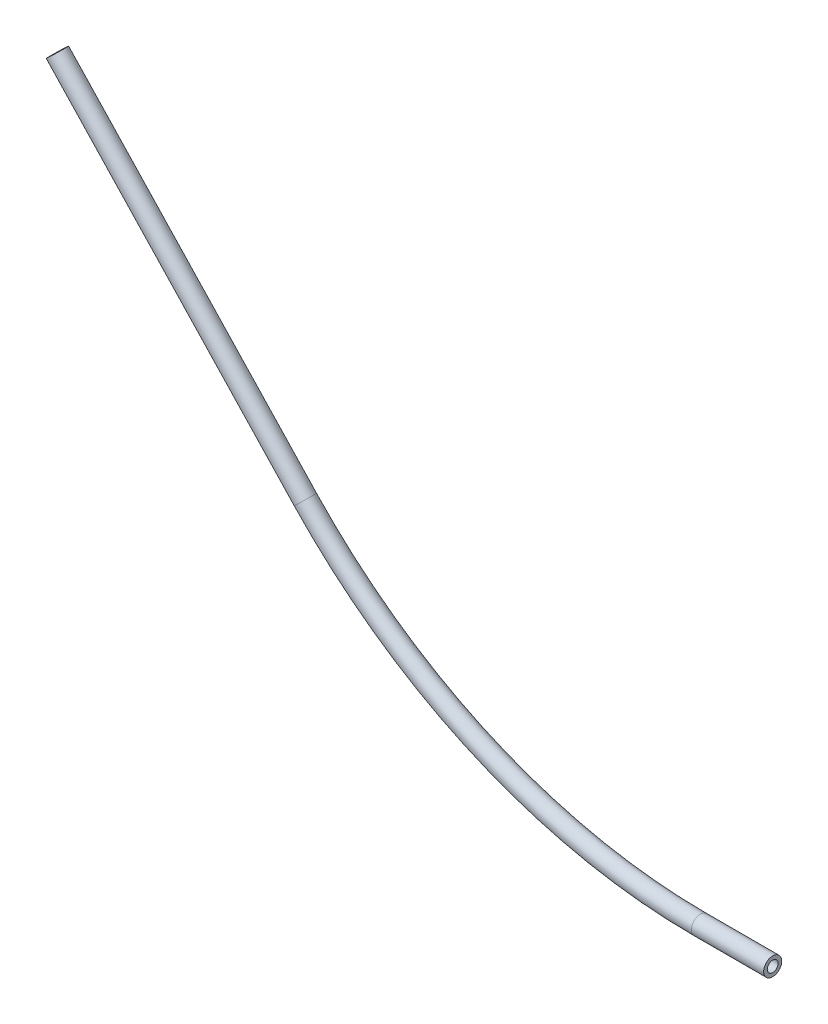
ISO-10303-21;
HEADER;
FILE_DESCRIPTION(('STEP AP214'),'2;1');
FILE_NAME('part.step','',(''),(''),'','','');
FILE_SCHEMA(('AUTOMOTIVE_DESIGN { 1 0 10303 214 1 1 1 1 }'));
ENDSEC;
DATA;
#1=APPLICATION_CONTEXT('core data for automotive mechanical design processes');
#2=APPLICATION_PROTOCOL_DEFINITION('international standard','automotive_design',2000,#1);
#3=PRODUCT_CONTEXT('',#1,'mechanical');
#4=PRODUCT('Part','Part','',(#3));
#5=PRODUCT_RELATED_PRODUCT_CATEGORY('part','',(#4));
#6=PRODUCT_DEFINITION_FORMATION('','',#4);
#7=PRODUCT_DEFINITION_CONTEXT('part definition',#1,'design');
#8=PRODUCT_DEFINITION('design','',#6,#7);
#9=PRODUCT_DEFINITION_SHAPE('','',#8);
#10=(LENGTH_UNIT() NAMED_UNIT(*) SI_UNIT(.MILLI.,.METRE.));
#11=(NAMED_UNIT(*) PLANE_ANGLE_UNIT() SI_UNIT($,.RADIAN.));
#12=(NAMED_UNIT(*) SI_UNIT($,.STERADIAN.) SOLID_ANGLE_UNIT());
#13=UNCERTAINTY_MEASURE_WITH_UNIT(LENGTH_MEASURE(1.E-05),#10,'distance_accuracy_value','');
#14=(GEOMETRIC_REPRESENTATION_CONTEXT(3) GLOBAL_UNCERTAINTY_ASSIGNED_CONTEXT((#13)) GLOBAL_UNIT_ASSIGNED_CONTEXT((#10,
#11,#12)) REPRESENTATION_CONTEXT('',''));
#15=CARTESIAN_POINT('',(0.,0.,0.));
#16=DIRECTION('',(0.,0.,1.));
#17=DIRECTION('',(1.,0.,0.));
#18=AXIS2_PLACEMENT_3D('',#15,#16,#17);
#19=CARTESIAN_POINT('',(0.,0.,0.));
#20=DIRECTION('',(-1.,0.,0.));
#21=DIRECTION('',(0.,-1.,0.));
#22=AXIS2_PLACEMENT_3D('',#19,#20,#21);
#23=CYLINDRICAL_SURFACE('',#22,3.175);
#24=CARTESIAN_POINT('',(-25.4,0.,0.));
#25=DIRECTION('',(1.,0.,0.));
#26=DIRECTION('',(0.,0.,-1.));
#27=AXIS2_PLACEMENT_3D('',#24,#25,#26);
#28=CIRCLE('',#27,3.175);
#29=CARTESIAN_POINT('',(-25.4,-3.17500000000001,0.));
#30=VERTEX_POINT('',#29);
#31=EDGE_CURVE('E96',#30,#30,#28,.T.);
#32=ORIENTED_EDGE('',*,*,#31,.T.);
#33=EDGE_LOOP('',(#32));
#34=FACE_BOUND('',#33,.T.);
#35=CARTESIAN_POINT('',(0.,0.,0.));
#36=DIRECTION('',(1.,0.,0.));
#37=DIRECTION('',(0.,0.,-1.));
#38=AXIS2_PLACEMENT_3D('',#35,#36,#37);
#39=CIRCLE('',#38,3.175);
#40=CARTESIAN_POINT('',(0.,0.,-3.175));
#41=VERTEX_POINT('',#40);
#42=EDGE_CURVE('E45',#41,#41,#39,.T.);
#43=ORIENTED_EDGE('',*,*,#42,.F.);
#44=EDGE_LOOP('',(#43));
#45=FACE_BOUND('',#44,.T.);
#46=ADVANCED_FACE('F30',(#34,#45),#23,.T.);
#47=CARTESIAN_POINT('',(-25.4,190.5,0.));
#48=DIRECTION('',(0.,0.,-1.));
#49=DIRECTION('',(-1.,0.,0.));
#50=AXIS2_PLACEMENT_3D('',#47,#48,#49);
#51=TOROIDAL_SURFACE('',#50,190.5,3.175);
#52=CARTESIAN_POINT('',(-164.110864907565,59.9260900616234,0.));
#53=DIRECTION('',(0.685427348757882,-0.728141023136824,0.));
#54=DIRECTION('',(0.,0.,-1.));
#55=AXIS2_PLACEMENT_3D('',#52,#53,#54);
#56=CIRCLE('',#55,3.175);
#57=CARTESIAN_POINT('',(-166.422712656024,57.7498582293171,0.));
#58=VERTEX_POINT('',#57);
#59=EDGE_CURVE('E34',#58,#58,#56,.T.);
#60=CARTESIAN_POINT('',(-25.4,190.5,0.));
#61=DIRECTION('',(0.,0.,-1.));
#62=DIRECTION('',(-1.,0.,0.));
#63=AXIS2_PLACEMENT_3D('',#60,#61,#62);
#64=CIRCLE('',#63,193.675);
#65=EDGE_CURVE('',#30,#58,#64,.T.);
#66=ORIENTED_EDGE('',*,*,#31,.F.);
#67=ORIENTED_EDGE('',*,*,#59,.T.);
#68=ORIENTED_EDGE('',*,*,#65,.T.);
#69=ORIENTED_EDGE('',*,*,#65,.F.);
#70=EDGE_LOOP('',(#66,#68,#67,#69));
#71=FACE_BOUND('',#70,.T.);
#72=ADVANCED_FACE('F103',(#71),#51,.T.);
#73=CARTESIAN_POINT('',(-164.110864907565,59.9260900616234,0.));
#74=DIRECTION('',(-0.685427348757882,0.728141023136823,0.));
#75=DIRECTION('',(-0.728141023136823,-0.685427348757883,0.));
#76=AXIS2_PLACEMENT_3D('',#73,#74,#75);
#77=CYLINDRICAL_SURFACE('',#76,3.175);
#78=CARTESIAN_POINT('',(-251.160138199816,152.4,0.));
#79=DIRECTION('',(0.685427348757882,-0.728141023136824,0.));
#80=DIRECTION('',(0.,0.,-1.));
#81=AXIS2_PLACEMENT_3D('',#78,#79,#80);
#82=CIRCLE('',#81,3.175);
#83=CARTESIAN_POINT('',(-251.160138199816,152.4,-3.175));
#84=VERTEX_POINT('',#83);
#85=EDGE_CURVE('E50',#84,#84,#82,.T.);
#86=ORIENTED_EDGE('',*,*,#85,.T.);
#87=EDGE_LOOP('',(#86));
#88=FACE_BOUND('',#87,.T.);
#89=ORIENTED_EDGE('',*,*,#59,.F.);
#90=EDGE_LOOP('',(#89));
#91=FACE_BOUND('',#90,.T.);
#92=ADVANCED_FACE('F32',(#88,#91),#77,.T.);
#93=CARTESIAN_POINT('',(0.,0.,0.));
#94=DIRECTION('',(1.,0.,0.));
#95=DIRECTION('',(0.,0.,-1.));
#96=AXIS2_PLACEMENT_3D('',#93,#94,#95);
#97=PLANE('',#96);
#98=CARTESIAN_POINT('',(0.,0.,0.));
#99=DIRECTION('',(1.,0.,0.));
#100=DIRECTION('',(0.,0.,-1.));
#101=AXIS2_PLACEMENT_3D('',#98,#99,#100);
#102=CIRCLE('',#101,1.905);
#103=CARTESIAN_POINT('',(0.,0.,-1.905));
#104=VERTEX_POINT('',#103);
#105=EDGE_CURVE('E89',#104,#104,#102,.F.);
#106=ORIENTED_EDGE('',*,*,#105,.T.);
#107=EDGE_LOOP('',(#106));
#108=FACE_BOUND('',#107,.T.);
#109=ORIENTED_EDGE('',*,*,#42,.T.);
#110=EDGE_LOOP('',(#109));
#111=FACE_BOUND('',#110,.T.);
#112=ADVANCED_FACE('F63',(#108,#111),#97,.T.);
#113=CARTESIAN_POINT('',(-251.160138199816,152.4,0.));
#114=DIRECTION('',(0.685427348757882,-0.728141023136824,0.));
#115=DIRECTION('',(0.,0.,-1.));
#116=AXIS2_PLACEMENT_3D('',#113,#114,#115);
#117=PLANE('',#116);
#118=CARTESIAN_POINT('',(-251.160138199816,152.4,0.));
#119=DIRECTION('',(0.685427348757882,-0.728141023136824,0.));
#120=DIRECTION('',(0.,0.,-1.));
#121=AXIS2_PLACEMENT_3D('',#118,#119,#120);
#122=CIRCLE('',#121,1.905);
#123=CARTESIAN_POINT('',(-251.160138199816,152.4,-1.905));
#124=VERTEX_POINT('',#123);
#125=EDGE_CURVE('E11',#124,#124,#122,.F.);
#126=ORIENTED_EDGE('',*,*,#125,.F.);
#127=EDGE_LOOP('',(#126));
#128=FACE_BOUND('',#127,.T.);
#129=ORIENTED_EDGE('',*,*,#85,.F.);
#130=EDGE_LOOP('',(#129));
#131=FACE_BOUND('',#130,.T.);
#132=ADVANCED_FACE('F60',(#128,#131),#117,.F.);
#133=CARTESIAN_POINT('',(0.,0.,0.));
#134=DIRECTION('',(-1.,0.,0.));
#135=DIRECTION('',(0.,-1.,0.));
#136=AXIS2_PLACEMENT_3D('',#133,#134,#135);
#137=CYLINDRICAL_SURFACE('',#136,1.905);
#138=CARTESIAN_POINT('',(-25.4,0.,0.));
#139=DIRECTION('',(1.,0.,0.));
#140=DIRECTION('',(0.,0.,-1.));
#141=AXIS2_PLACEMENT_3D('',#138,#139,#140);
#142=CIRCLE('',#141,1.905);
#143=CARTESIAN_POINT('',(-25.4,-1.90499999999999,0.));
#144=VERTEX_POINT('',#143);
#145=EDGE_CURVE('E88',#144,#144,#142,.F.);
#146=ORIENTED_EDGE('',*,*,#145,.T.);
#147=EDGE_LOOP('',(#146));
#148=FACE_BOUND('',#147,.T.);
#149=ORIENTED_EDGE('',*,*,#105,.F.);
#150=EDGE_LOOP('',(#149));
#151=FACE_BOUND('',#150,.T.);
#152=ADVANCED_FACE('F62',(#148,#151),#137,.F.);
#153=CARTESIAN_POINT('',(-25.4,190.5,0.));
#154=DIRECTION('',(0.,0.,-1.));
#155=DIRECTION('',(-1.,0.,0.));
#156=AXIS2_PLACEMENT_3D('',#153,#154,#155);
#157=TOROIDAL_SURFACE('',#156,190.5,1.905);
#158=CARTESIAN_POINT('',(-164.110864907565,59.9260900616234,0.));
#159=DIRECTION('',(0.685427348757882,-0.728141023136824,0.));
#160=DIRECTION('',(0.,0.,-1.));
#161=AXIS2_PLACEMENT_3D('',#158,#159,#160);
#162=CIRCLE('',#161,1.905);
#163=CARTESIAN_POINT('',(-165.497973556641,58.6203509622397,0.));
#164=VERTEX_POINT('',#163);
#165=EDGE_CURVE('E39',#164,#164,#162,.F.);
#166=CARTESIAN_POINT('',(-25.4,190.5,0.));
#167=DIRECTION('',(0.,0.,-1.));
#168=DIRECTION('',(-1.,0.,0.));
#169=AXIS2_PLACEMENT_3D('',#166,#167,#168);
#170=CIRCLE('',#169,192.405);
#171=EDGE_CURVE('',#144,#164,#170,.T.);
#172=ORIENTED_EDGE('',*,*,#145,.F.);
#173=ORIENTED_EDGE('',*,*,#165,.T.);
#174=ORIENTED_EDGE('',*,*,#171,.T.);
#175=ORIENTED_EDGE('',*,*,#171,.F.);
#176=EDGE_LOOP('',(#172,#174,#173,#175));
#177=FACE_BOUND('',#176,.T.);
#178=ADVANCED_FACE('F69',(#177),#157,.F.);
#179=CARTESIAN_POINT('',(-164.110864907565,59.9260900616234,0.));
#180=DIRECTION('',(-0.685427348757882,0.728141023136823,0.));
#181=DIRECTION('',(-0.728141023136823,-0.685427348757883,0.));
#182=AXIS2_PLACEMENT_3D('',#179,#180,#181);
#183=CYLINDRICAL_SURFACE('',#182,1.905);
#184=ORIENTED_EDGE('',*,*,#125,.T.);
#185=EDGE_LOOP('',(#184));
#186=FACE_BOUND('',#185,.T.);
#187=ORIENTED_EDGE('',*,*,#165,.F.);
#188=EDGE_LOOP('',(#187));
#189=FACE_BOUND('',#188,.T.);
#190=ADVANCED_FACE('F57',(#186,#189),#183,.F.);
#191=CLOSED_SHELL('',(#46,#72,#92,#112,#132,#152,#178,#190));
#192=MANIFOLD_SOLID_BREP('B2',#191);
#193=ADVANCED_BREP_SHAPE_REPRESENTATION('',(#18,#192),#14);
#194=SHAPE_DEFINITION_REPRESENTATION(#9,#193);
ENDSEC;
END-ISO-10303-21;
